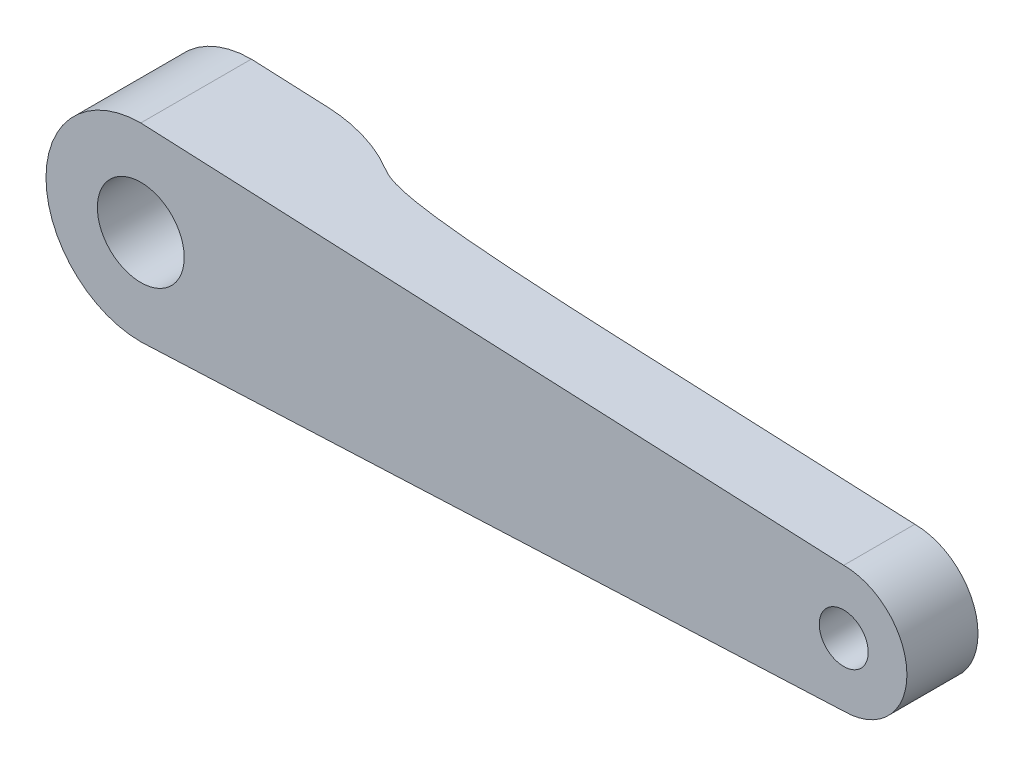
ISO-10303-21;
HEADER;
FILE_DESCRIPTION(('STEP AP214'),'2;1');
FILE_NAME('part.step','',(''),(''),'','','');
FILE_SCHEMA(('AUTOMOTIVE_DESIGN { 1 0 10303 214 1 1 1 1 }'));
ENDSEC;
DATA;
#1=APPLICATION_CONTEXT('core data for automotive mechanical design processes');
#2=APPLICATION_PROTOCOL_DEFINITION('international standard','automotive_design',2000,#1);
#3=PRODUCT_CONTEXT('',#1,'mechanical');
#4=PRODUCT('Part','Part','',(#3));
#5=PRODUCT_RELATED_PRODUCT_CATEGORY('part','',(#4));
#6=PRODUCT_DEFINITION_FORMATION('','',#4);
#7=PRODUCT_DEFINITION_CONTEXT('part definition',#1,'design');
#8=PRODUCT_DEFINITION('design','',#6,#7);
#9=PRODUCT_DEFINITION_SHAPE('','',#8);
#10=(LENGTH_UNIT() NAMED_UNIT(*) SI_UNIT(.MILLI.,.METRE.));
#11=(NAMED_UNIT(*) PLANE_ANGLE_UNIT() SI_UNIT($,.RADIAN.));
#12=(NAMED_UNIT(*) SI_UNIT($,.STERADIAN.) SOLID_ANGLE_UNIT());
#13=UNCERTAINTY_MEASURE_WITH_UNIT(LENGTH_MEASURE(1.E-05),#10,'distance_accuracy_value','');
#14=(GEOMETRIC_REPRESENTATION_CONTEXT(3) GLOBAL_UNCERTAINTY_ASSIGNED_CONTEXT((#13)) GLOBAL_UNIT_ASSIGNED_CONTEXT((#10,
#11,#12)) REPRESENTATION_CONTEXT('',''));
#15=CARTESIAN_POINT('',(0.,0.,0.));
#16=DIRECTION('',(0.,0.,1.));
#17=DIRECTION('',(1.,0.,0.));
#18=AXIS2_PLACEMENT_3D('',#15,#16,#17);
#19=CARTESIAN_POINT('',(0.269119314602494,-5.98790474990551,7.));
#20=DIRECTION('',(-0.0448984968094591,0.998991554010469,0.));
#21=DIRECTION('',(-0.998991554010469,-0.0448984968094591,0.));
#22=AXIS2_PLACEMENT_3D('',#19,#20,#21);
#23=PLANE('',#22);
#24=DIRECTION('',(0.998991554010469,0.0448984968094592,0.));
#25=VECTOR('',#24,1.);
#26=CARTESIAN_POINT('',(0.269119314602494,-5.98790474990551,0.));
#27=LINE('',#26,#25);
#28=CARTESIAN_POINT('',(0.,-6.,0.));
#29=VERTEX_POINT('',#28);
#30=CARTESIAN_POINT('',(4.83224619586164,-5.78282039569161,0.));
#31=VERTEX_POINT('',#30);
#32=EDGE_CURVE('E213',#29,#31,#27,.T.);
#33=ORIENTED_EDGE('',*,*,#32,.T.);
#34=CARTESIAN_POINT('',(4.83224619586164,-5.78282039569161,10.));
#35=DIRECTION('',(-0.0448984968094591,0.998991554010469,0.));
#36=DIRECTION('',(0.998991554010469,0.0448984968094591,0.));
#37=AXIS2_PLACEMENT_3D('',#34,#35,#36);
#38=ELLIPSE('',#37,10.0100946397943,10.);
#39=CARTESIAN_POINT('',(9.92616284542109,-5.55388032155411,1.39465206006515));
#40=VERTEX_POINT('',#39);
#41=EDGE_CURVE('E65',#31,#40,#38,.F.);
#42=ORIENTED_EDGE('',*,*,#41,.T.);
#43=CARTESIAN_POINT('',(9.,-5.59550561797753,0.));
#44=CARTESIAN_POINT('',(9.0197236961108,-5.59461915972536,0.0464110950098341));
#45=CARTESIAN_POINT('',(9.03856608160202,-5.59377231093924,0.0931738483475077));
#46=CARTESIAN_POINT('',(9.07539874100431,-5.59211691051666,0.187406937910348));
#47=CARTESIAN_POINT('',(9.09338229795599,-5.59130866076602,0.234879926602944));
#48=CARTESIAN_POINT('',(9.12921614697412,-5.58969815069779,0.330044521995679));
#49=CARTESIAN_POINT('',(9.14706583393983,-5.58889591757574,0.377736344016202));
#50=CARTESIAN_POINT('',(9.18410247172186,-5.58723134958554,0.473986394272832));
#51=CARTESIAN_POINT('',(9.20331176343384,-5.58636801063219,0.522536249827667));
#52=CARTESIAN_POINT('',(9.24385750871294,-5.58454572994549,0.618588504891965));
#53=CARTESIAN_POINT('',(9.2651874563837,-5.58358708061197,0.666093593449808));
#54=CARTESIAN_POINT('',(9.31120238889283,-5.58151899375763,0.759378646526527));
#55=CARTESIAN_POINT('',(9.33588080052951,-5.5804098516616,0.805161771891768));
#56=CARTESIAN_POINT('',(9.3793077403341,-5.57845807908611,0.87731978617561));
#57=CARTESIAN_POINT('',(9.39676060832497,-5.57767368052472,0.904476152397463));
#58=CARTESIAN_POINT('',(9.43339893405827,-5.57602701419963,0.957631817315344));
#59=CARTESIAN_POINT('',(9.45258589567841,-5.57516467884592,0.983630081919395));
#60=CARTESIAN_POINT('',(9.49267192828292,-5.57336305940302,1.03426553257482));
#61=CARTESIAN_POINT('',(9.51357082697932,-5.57242378305711,1.05890285517348));
#62=CARTESIAN_POINT('',(9.55671679037795,-5.5704846386347,1.10640426568289));
#63=CARTESIAN_POINT('',(9.57894378721268,-5.56948567248483,1.1292866386958));
#64=CARTESIAN_POINT('',(9.62483083420657,-5.56742333329409,1.17356652293696));
#65=CARTESIAN_POINT('',(9.64849105638532,-5.56635995252201,1.19496385526266));
#66=CARTESIAN_POINT('',(9.69706230096039,-5.56417697523774,1.23628019657253));
#67=CARTESIAN_POINT('',(9.72197340087065,-5.56305737524177,1.2561991137528));
#68=CARTESIAN_POINT('',(9.79918101844689,-5.55958736995744,1.31447617522593));
#69=CARTESIAN_POINT('',(9.85316460698408,-5.55716114125914,1.35060820025465));
#70=CARTESIAN_POINT('',(9.96419026942951,-5.55217122384587,1.4177709648512));
#71=CARTESIAN_POINT('',(10.0212343894077,-5.54960744317269,1.44879823391296));
#72=CARTESIAN_POINT('',(10.1381380705169,-5.54435334514531,1.50701729104118));
#73=CARTESIAN_POINT('',(10.1980244258772,-5.54166182355608,1.53415454928966));
#74=CARTESIAN_POINT('',(10.3192200730239,-5.5362148281787,1.58491677180607));
#75=CARTESIAN_POINT('',(10.3805288720795,-5.53345937653575,1.60854293191341));
#76=CARTESIAN_POINT('',(10.5183068780731,-5.52726710660346,1.65804451844934));
#77=CARTESIAN_POINT('',(10.5950334610544,-5.52381872085149,1.68319653668897));
#78=CARTESIAN_POINT('',(10.7495106387791,-5.51687592634701,1.73015459224607));
#79=CARTESIAN_POINT('',(10.8272615344642,-5.51338150406903,1.75195962129346));
#80=CARTESIAN_POINT('',(10.9836083211613,-5.506354682195,1.79293558842061));
#81=CARTESIAN_POINT('',(11.0622055610689,-5.50282222197443,1.81210132314357));
#82=CARTESIAN_POINT('',(11.2199015508644,-5.4957347617589,1.84825314694667));
#83=CARTESIAN_POINT('',(11.2990003485809,-5.49217975961434,1.86523902477332));
#84=CARTESIAN_POINT('',(11.5370015227225,-5.48148307763045,1.91355413212303));
#85=CARTESIAN_POINT('',(11.696446581161,-5.47431700758827,1.94220026094863));
#86=CARTESIAN_POINT('',(12.0160550328165,-5.45995258279477,1.99442393157232));
#87=CARTESIAN_POINT('',(12.1762180363545,-5.4527542455571,2.01800394671231));
#88=CARTESIAN_POINT('',(12.4968041556466,-5.4383458806451,2.06135742149571));
#89=CARTESIAN_POINT('',(12.6572265054988,-5.43113588739331,2.08113661507716));
#90=CARTESIAN_POINT('',(12.9783217731553,-5.41670463940875,2.11777850032749));
#91=CARTESIAN_POINT('',(13.138994538364,-5.4094833915342,2.13464255398597));
#92=CARTESIAN_POINT('',(13.5379181261682,-5.39155424152053,2.17362859752155));
#93=CARTESIAN_POINT('',(13.7763021963195,-5.38084035072722,2.194376776026));
#94=CARTESIAN_POINT('',(14.2533687368337,-5.35939915789512,2.23213792426364));
#95=CARTESIAN_POINT('',(14.4920512205215,-5.34867185525746,2.24915072074234));
#96=CARTESIAN_POINT('',(14.9697396920707,-5.32720271046874,2.28029762025646));
#97=CARTESIAN_POINT('',(15.2087457871137,-5.31646086350051,2.29443005757518));
#98=CARTESIAN_POINT('',(15.6868836383937,-5.29497152186995,2.32039488036477));
#99=CARTESIAN_POINT('',(15.9260153961614,-5.28422402713882,2.33222723713315));
#100=CARTESIAN_POINT('',(16.6422512975503,-5.2520336495483,2.36488474999077));
#101=CARTESIAN_POINT('',(17.1194807027153,-5.23058513695662,2.38294886693849));
#102=CARTESIAN_POINT('',(18.0739894118856,-5.18768586912874,2.41394764347585));
#103=CARTESIAN_POINT('',(18.55126868097,-5.16623511546203,2.42688344723063));
#104=CARTESIAN_POINT('',(19.5539639219039,-5.12117016081331,2.45007431844182));
#105=CARTESIAN_POINT('',(20.0793889781982,-5.09755555154166,2.45992843270219));
#106=CARTESIAN_POINT('',(21.1303347264904,-5.05032203476448,2.47620886283438));
#107=CARTESIAN_POINT('',(21.6558554228272,-5.02670312706395,2.48263488363882));
#108=CARTESIAN_POINT('',(22.706950291218,-4.97946290825987,2.49282830876571));
#109=CARTESIAN_POINT('',(23.2325244646253,-4.9558415970955,2.49659556811273));
#110=CARTESIAN_POINT('',(24.2850214612836,-4.90853836129063,2.50202088129101));
#111=CARTESIAN_POINT('',(24.811944310678,-4.88485643547515,2.50367353956502));
#112=CARTESIAN_POINT('',(25.8657599593421,-4.8374939344116,2.50525436943824));
#113=CARTESIAN_POINT('',(26.3926527584816,-4.81381335916937,2.5051826463527));
#114=CARTESIAN_POINT('',(27.4463647361164,-4.76645551747792,2.50359962789058));
#115=CARTESIAN_POINT('',(27.9731839148872,-4.74277825101631,2.50208852811706));
#116=CARTESIAN_POINT('',(28.5,-4.71910112359551,2.5));
#117=B_SPLINE_CURVE_WITH_KNOTS('',3,(#43,#44,#45,#46,#47,#48,#49,#50,#51,#52,#53,#54,#55,#56,
#57,#58,#59,#60,#61,#62,#63,#64,#65,#66,#67,#68,#69,#70,#71,#72,#73,#74,#75,#76,#77,#78,#79,#80,
#81,#82,#83,#84,#85,#86,#87,#88,#89,#90,#91,#92,#93,#94,#95,#96,#97,#98,#99,#100,#101,#102,#103,
#104,#105,#106,#107,#108,#109,#110,#111,#112,#113,#114,#115,#116),.UNSPECIFIED.,.F.,.F.,(4,2,2,
2,2,2,2,2,2,2,2,2,2,2,2,2,2,2,2,2,2,2,2,2,2,2,2,2,2,2,2,2,2,2,2,2,4),(0.,0.151270301755634,
0.303576241413847,0.456366182702525,0.612998456706788,0.769164220330555,0.92502774229721,
1.02184029168505,1.11873762167671,1.21562521195143,1.31130428022025,1.40699485499084,
1.50269136681471,1.697320615909,1.89208164319371,2.08935041813252,2.28655185086498,
2.52890115312104,2.77132331967133,3.01421677986102,3.25713376150387,3.74346897200961,
4.22956620513448,4.71492425121079,5.20005491544597,5.9185862623827,6.6371509292036,
7.35612997145232,8.07511798520021,9.50922952077278,10.9430209150012,12.5211483535095,
14.0994116047826,15.6777609080511,17.2601295045075,18.8424014592688,20.4244584229967),.UNSPECIFIED.);
#118=CARTESIAN_POINT('',(28.5,-4.71910112359551,2.5));
#119=VERTEX_POINT('',#118);
#120=EDGE_CURVE('E98',#40,#119,#117,.T.);
#121=ORIENTED_EDGE('',*,*,#120,.T.);
#122=DIRECTION('',(0.998991554010469,0.0448984968094591,0.));
#123=VECTOR('',#122,1.);
#124=CARTESIAN_POINT('',(0.269119314602493,-5.98790474990551,2.50000000000001));
#125=LINE('',#124,#123);
#126=CARTESIAN_POINT('',(44.5,-4.00000000000001,2.5));
#127=VERTEX_POINT('',#126);
#128=EDGE_CURVE('E101',#119,#127,#125,.T.);
#129=ORIENTED_EDGE('',*,*,#128,.T.);
#130=DIRECTION('',(0.,0.,-1.));
#131=VECTOR('',#130,1.);
#132=CARTESIAN_POINT('',(44.5,-4.00000000000001,7.));
#133=LINE('',#132,#131);
#134=CARTESIAN_POINT('',(44.5,-4.00000000000001,7.));
#135=VERTEX_POINT('',#134);
#136=EDGE_CURVE('E187',#135,#127,#133,.T.);
#137=ORIENTED_EDGE('',*,*,#136,.F.);
#138=DIRECTION('',(0.998991554010469,0.0448984968094592,0.));
#139=VECTOR('',#138,1.);
#140=CARTESIAN_POINT('',(0.269119314602494,-5.98790474990551,7.));
#141=LINE('',#140,#139);
#142=CARTESIAN_POINT('',(0.,-6.,7.));
#143=VERTEX_POINT('',#142);
#144=EDGE_CURVE('E231',#143,#135,#141,.T.);
#145=ORIENTED_EDGE('',*,*,#144,.F.);
#146=DIRECTION('',(0.,0.,-1.));
#147=VECTOR('',#146,1.);
#148=CARTESIAN_POINT('',(0.,-6.,7.));
#149=LINE('',#148,#147);
#150=EDGE_CURVE('E196',#143,#29,#149,.T.);
#151=ORIENTED_EDGE('',*,*,#150,.T.);
#152=EDGE_LOOP('',(#33,#42,#121,#129,#137,#145,#151));
#153=FACE_BOUND('',#152,.T.);
#154=ADVANCED_FACE('F43',(#153),#23,.F.);
#155=CARTESIAN_POINT('',(44.5,0.,7.));
#156=DIRECTION('',(0.,0.,-1.));
#157=DIRECTION('',(-1.,0.,0.));
#158=AXIS2_PLACEMENT_3D('',#155,#156,#157);
#159=CYLINDRICAL_SURFACE('',#158,4.00000000000001);
#160=CARTESIAN_POINT('',(44.5,0.,2.5));
#161=DIRECTION('',(0.,0.,1.));
#162=DIRECTION('',(1.,0.,0.));
#163=AXIS2_PLACEMENT_3D('',#160,#161,#162);
#164=CIRCLE('',#163,4.00000000000001);
#165=CARTESIAN_POINT('',(44.5,4.00000000000001,2.5));
#166=VERTEX_POINT('',#165);
#167=EDGE_CURVE('E113',#127,#166,#164,.T.);
#168=ORIENTED_EDGE('',*,*,#167,.T.);
#169=DIRECTION('',(0.,0.,-1.));
#170=VECTOR('',#169,1.);
#171=CARTESIAN_POINT('',(44.5,4.00000000000001,7.));
#172=LINE('',#171,#170);
#173=CARTESIAN_POINT('',(44.5,4.00000000000001,7.));
#174=VERTEX_POINT('',#173);
#175=EDGE_CURVE('E185',#174,#166,#172,.T.);
#176=ORIENTED_EDGE('',*,*,#175,.F.);
#177=CARTESIAN_POINT('',(44.5,0.,7.));
#178=DIRECTION('',(0.,0.,1.));
#179=DIRECTION('',(1.,0.,0.));
#180=AXIS2_PLACEMENT_3D('',#177,#178,#179);
#181=CIRCLE('',#180,4.00000000000001);
#182=EDGE_CURVE('E239',#135,#174,#181,.T.);
#183=ORIENTED_EDGE('',*,*,#182,.F.);
#184=ORIENTED_EDGE('',*,*,#136,.T.);
#185=EDGE_LOOP('',(#168,#176,#183,#184));
#186=FACE_BOUND('',#185,.T.);
#187=ADVANCED_FACE('F172',(#186),#159,.T.);
#188=CARTESIAN_POINT('',(0.269119314602494,5.98790474990551,7.));
#189=DIRECTION('',(0.0448984968094591,0.998991554010469,0.));
#190=DIRECTION('',(-0.998991554010469,0.0448984968094591,0.));
#191=AXIS2_PLACEMENT_3D('',#188,#189,#190);
#192=PLANE('',#191);
#193=CARTESIAN_POINT('',(9.,5.59550561797753,0.));
#194=CARTESIAN_POINT('',(9.0197236961108,5.59461915972536,0.0464110950098343));
#195=CARTESIAN_POINT('',(9.03856608160202,5.59377231093924,0.093173848347508));
#196=CARTESIAN_POINT('',(9.07539874100431,5.59211691051666,0.187406937910348));
#197=CARTESIAN_POINT('',(9.09338229795599,5.59130866076602,0.234879926602944));
#198=CARTESIAN_POINT('',(9.12921614697412,5.58969815069779,0.330044521995679));
#199=CARTESIAN_POINT('',(9.14706583393983,5.58889591757574,0.377736344016202));
#200=CARTESIAN_POINT('',(9.18410247172186,5.58723134958554,0.473986394272832));
#201=CARTESIAN_POINT('',(9.20331176343384,5.58636801063219,0.522536249827666));
#202=CARTESIAN_POINT('',(9.24385750871294,5.58454572994549,0.618588504891964));
#203=CARTESIAN_POINT('',(9.2651874563837,5.58358708061197,0.666093593449808));
#204=CARTESIAN_POINT('',(9.31120238889283,5.58151899375763,0.759378646526527));
#205=CARTESIAN_POINT('',(9.3358808005295,5.5804098516616,0.805161771891768));
#206=CARTESIAN_POINT('',(9.3793077403341,5.57845807908611,0.87731978617561));
#207=CARTESIAN_POINT('',(9.39676060832497,5.57767368052472,0.904476152397463));
#208=CARTESIAN_POINT('',(9.43339893405828,5.57602701419963,0.957631817315344));
#209=CARTESIAN_POINT('',(9.45258589567841,5.57516467884592,0.983630081919393));
#210=CARTESIAN_POINT('',(9.49267192828292,5.57336305940302,1.03426553257482));
#211=CARTESIAN_POINT('',(9.51357082697932,5.57242378305711,1.05890285517348));
#212=CARTESIAN_POINT('',(9.55671679037795,5.5704846386347,1.1064042656829));
#213=CARTESIAN_POINT('',(9.57894378721268,5.56948567248483,1.1292866386958));
#214=CARTESIAN_POINT('',(9.62483083420658,5.56742333329409,1.17356652293696));
#215=CARTESIAN_POINT('',(9.64849105638532,5.56635995252201,1.19496385526266));
#216=CARTESIAN_POINT('',(9.6970623009604,5.56417697523774,1.23628019657252));
#217=CARTESIAN_POINT('',(9.72197340087065,5.56305737524177,1.2561991137528));
#218=CARTESIAN_POINT('',(9.79918101844689,5.55958736995744,1.31447617522593));
#219=CARTESIAN_POINT('',(9.85316460698408,5.55716114125914,1.35060820025465));
#220=CARTESIAN_POINT('',(9.96419026942951,5.55217122384587,1.4177709648512));
#221=CARTESIAN_POINT('',(10.0212343894077,5.54960744317269,1.44879823391296));
#222=CARTESIAN_POINT('',(10.1381380705169,5.54435334514531,1.50701729104118));
#223=CARTESIAN_POINT('',(10.1980244258772,5.54166182355608,1.53415454928966));
#224=CARTESIAN_POINT('',(10.3192200730239,5.5362148281787,1.58491677180607));
#225=CARTESIAN_POINT('',(10.3805288720795,5.53345937653575,1.60854293191341));
#226=CARTESIAN_POINT('',(10.5183068780731,5.52726710660346,1.65804451844934));
#227=CARTESIAN_POINT('',(10.5950334610544,5.52381872085149,1.68319653668897));
#228=CARTESIAN_POINT('',(10.7495106387791,5.51687592634701,1.73015459224607));
#229=CARTESIAN_POINT('',(10.8272615344642,5.51338150406903,1.75195962129345));
#230=CARTESIAN_POINT('',(10.9836083211613,5.506354682195,1.79293558842061));
#231=CARTESIAN_POINT('',(11.0622055610689,5.50282222197443,1.81210132314357));
#232=CARTESIAN_POINT('',(11.2199015508644,5.4957347617589,1.84825314694666));
#233=CARTESIAN_POINT('',(11.2990003485809,5.49217975961434,1.86523902477332));
#234=CARTESIAN_POINT('',(11.5370015227225,5.48148307763045,1.91355413212303));
#235=CARTESIAN_POINT('',(11.696446581161,5.47431700758827,1.94220026094863));
#236=CARTESIAN_POINT('',(12.0160550328165,5.45995258279477,1.99442393157232));
#237=CARTESIAN_POINT('',(12.1762180363545,5.4527542455571,2.0180039467123));
#238=CARTESIAN_POINT('',(12.4968041556466,5.4383458806451,2.06135742149571));
#239=CARTESIAN_POINT('',(12.6572265054988,5.43113588739331,2.08113661507716));
#240=CARTESIAN_POINT('',(12.9783217731553,5.41670463940875,2.11777850032749));
#241=CARTESIAN_POINT('',(13.138994538364,5.40948339153421,2.13464255398597));
#242=CARTESIAN_POINT('',(13.5379181261682,5.39155424152053,2.17362859752155));
#243=CARTESIAN_POINT('',(13.7763021963195,5.38084035072722,2.194376776026));
#244=CARTESIAN_POINT('',(14.2533687368337,5.35939915789512,2.23213792426364));
#245=CARTESIAN_POINT('',(14.4920512205215,5.34867185525746,2.24915072074234));
#246=CARTESIAN_POINT('',(14.9697396920706,5.32720271046874,2.28029762025646));
#247=CARTESIAN_POINT('',(15.2087457871137,5.31646086350051,2.29443005757518));
#248=CARTESIAN_POINT('',(15.6868836383936,5.29497152186995,2.32039488036477));
#249=CARTESIAN_POINT('',(15.9260153961614,5.28422402713882,2.33222723713315));
#250=CARTESIAN_POINT('',(16.6422512975503,5.2520336495483,2.36488474999077));
#251=CARTESIAN_POINT('',(17.1194807027153,5.23058513695662,2.38294886693848));
#252=CARTESIAN_POINT('',(18.0739894118856,5.18768586912874,2.41394764347585));
#253=CARTESIAN_POINT('',(18.5512686809699,5.16623511546203,2.42688344723062));
#254=CARTESIAN_POINT('',(19.5539639219039,5.12117016081331,2.45007431844182));
#255=CARTESIAN_POINT('',(20.0793889781982,5.09755555154166,2.45992843270219));
#256=CARTESIAN_POINT('',(21.1303347264904,5.05032203476448,2.47620886283438));
#257=CARTESIAN_POINT('',(21.6558554228272,5.02670312706395,2.48263488363882));
#258=CARTESIAN_POINT('',(22.706950291218,4.97946290825987,2.49282830876571));
#259=CARTESIAN_POINT('',(23.2325244646253,4.9558415970955,2.49659556811273));
#260=CARTESIAN_POINT('',(24.2850214612836,4.90853836129063,2.50202088129101));
#261=CARTESIAN_POINT('',(24.811944310678,4.88485643547515,2.50367353956502));
#262=CARTESIAN_POINT('',(25.8657599593421,4.83749393441159,2.50525436943824));
#263=CARTESIAN_POINT('',(26.3926527584816,4.81381335916937,2.5051826463527));
#264=CARTESIAN_POINT('',(27.4463647361164,4.76645551747792,2.50359962789058));
#265=CARTESIAN_POINT('',(27.9731839148872,4.74277825101631,2.50208852811706));
#266=CARTESIAN_POINT('',(28.5,4.71910112359551,2.5));
#267=B_SPLINE_CURVE_WITH_KNOTS('',3,(#193,#194,#195,#196,#197,#198,#199,#200,#201,#202,#203,
#204,#205,#206,#207,#208,#209,#210,#211,#212,#213,#214,#215,#216,#217,#218,#219,#220,#221,#222,
#223,#224,#225,#226,#227,#228,#229,#230,#231,#232,#233,#234,#235,#236,#237,#238,#239,#240,#241,
#242,#243,#244,#245,#246,#247,#248,#249,#250,#251,#252,#253,#254,#255,#256,#257,#258,#259,#260,
#261,#262,#263,#264,#265,#266),.UNSPECIFIED.,.F.,.F.,(4,2,2,2,2,2,2,2,2,2,2,2,2,2,2,2,2,2,2,2,2,
2,2,2,2,2,2,2,2,2,2,2,2,2,2,2,4),(0.,0.151270301755635,0.303576241413847,0.456366182702525,
0.612998456706788,0.769164220330554,0.92502774229721,1.02184029168505,1.11873762167671,
1.21562521195143,1.31130428022025,1.40699485499084,1.50269136681471,1.697320615909,
1.89208164319371,2.08935041813252,2.28655185086498,2.52890115312104,2.77132331967133,
3.01421677986101,3.25713376150387,3.7434689720096,4.22956620513448,4.71492425121078,
5.20005491544596,5.91858626238269,6.63715092920359,7.3561299714523,8.0751179852002,
9.50922952077275,10.9430209150011,12.5211483535095,14.0994116047826,15.6777609080511,
17.2601295045075,18.8424014592687,20.4244584229967),.UNSPECIFIED.);
#268=CARTESIAN_POINT('',(9.92616284542109,5.55388032155411,1.39465206006515));
#269=VERTEX_POINT('',#268);
#270=CARTESIAN_POINT('',(28.5,4.71910112359551,2.5));
#271=VERTEX_POINT('',#270);
#272=EDGE_CURVE('E105',#269,#271,#267,.T.);
#273=ORIENTED_EDGE('',*,*,#272,.F.);
#274=CARTESIAN_POINT('',(4.83224619586164,5.78282039569161,10.));
#275=DIRECTION('',(0.0448984968094591,0.998991554010469,0.));
#276=DIRECTION('',(-0.998991554010469,0.0448984968094591,0.));
#277=AXIS2_PLACEMENT_3D('',#274,#275,#276);
#278=ELLIPSE('',#277,10.0100946397943,10.);
#279=CARTESIAN_POINT('',(4.83224619586164,5.78282039569161,0.));
#280=VERTEX_POINT('',#279);
#281=EDGE_CURVE('E11',#269,#280,#278,.T.);
#282=ORIENTED_EDGE('',*,*,#281,.T.);
#283=DIRECTION('',(0.998991554010469,-0.0448984968094592,0.));
#284=VECTOR('',#283,1.);
#285=CARTESIAN_POINT('',(0.269119314602494,5.98790474990551,0.));
#286=LINE('',#285,#284);
#287=CARTESIAN_POINT('',(0.,6.,0.));
#288=VERTEX_POINT('',#287);
#289=EDGE_CURVE('E215',#288,#280,#286,.T.);
#290=ORIENTED_EDGE('',*,*,#289,.F.);
#291=DIRECTION('',(0.,0.,-1.));
#292=VECTOR('',#291,1.);
#293=CARTESIAN_POINT('',(0.,6.,7.));
#294=LINE('',#293,#292);
#295=CARTESIAN_POINT('',(0.,6.,7.));
#296=VERTEX_POINT('',#295);
#297=EDGE_CURVE('E192',#296,#288,#294,.T.);
#298=ORIENTED_EDGE('',*,*,#297,.F.);
#299=DIRECTION('',(0.998991554010469,-0.0448984968094592,0.));
#300=VECTOR('',#299,1.);
#301=CARTESIAN_POINT('',(0.269119314602494,5.98790474990551,7.));
#302=LINE('',#301,#300);
#303=EDGE_CURVE('E191',#296,#174,#302,.T.);
#304=ORIENTED_EDGE('',*,*,#303,.T.);
#305=ORIENTED_EDGE('',*,*,#175,.T.);
#306=DIRECTION('',(0.998991554010469,-0.0448984968094591,0.));
#307=VECTOR('',#306,1.);
#308=CARTESIAN_POINT('',(0.269119314602493,5.98790474990551,2.50000000000001));
#309=LINE('',#308,#307);
#310=EDGE_CURVE('E188',#271,#166,#309,.T.);
#311=ORIENTED_EDGE('',*,*,#310,.F.);
#312=EDGE_LOOP('',(#273,#282,#290,#298,#304,#305,#311));
#313=FACE_BOUND('',#312,.T.);
#314=ADVANCED_FACE('F134',(#313),#192,.T.);
#315=CARTESIAN_POINT('',(0.,0.,7.));
#316=DIRECTION('',(0.,0.,-1.));
#317=DIRECTION('',(-1.,0.,0.));
#318=AXIS2_PLACEMENT_3D('',#315,#316,#317);
#319=CYLINDRICAL_SURFACE('',#318,6.);
#320=CARTESIAN_POINT('',(0.,0.,0.));
#321=DIRECTION('',(0.,0.,1.));
#322=DIRECTION('',(1.,0.,0.));
#323=AXIS2_PLACEMENT_3D('',#320,#321,#322);
#324=CIRCLE('',#323,6.);
#325=EDGE_CURVE('E223',#288,#29,#324,.T.);
#326=ORIENTED_EDGE('',*,*,#325,.T.);
#327=ORIENTED_EDGE('',*,*,#150,.F.);
#328=CARTESIAN_POINT('',(0.,0.,7.));
#329=DIRECTION('',(0.,0.,1.));
#330=DIRECTION('',(1.,0.,0.));
#331=AXIS2_PLACEMENT_3D('',#328,#329,#330);
#332=CIRCLE('',#331,6.);
#333=EDGE_CURVE('E233',#296,#143,#332,.T.);
#334=ORIENTED_EDGE('',*,*,#333,.F.);
#335=ORIENTED_EDGE('',*,*,#297,.T.);
#336=EDGE_LOOP('',(#326,#327,#334,#335));
#337=FACE_BOUND('',#336,.T.);
#338=ADVANCED_FACE('F165',(#337),#319,.T.);
#339=CARTESIAN_POINT('',(44.5,0.,7.));
#340=DIRECTION('',(0.,0.,-1.));
#341=DIRECTION('',(-1.,0.,0.));
#342=AXIS2_PLACEMENT_3D('',#339,#340,#341);
#343=CYLINDRICAL_SURFACE('',#342,1.55);
#344=CARTESIAN_POINT('',(44.5,0.,2.5));
#345=DIRECTION('',(0.,0.,1.));
#346=DIRECTION('',(1.,0.,0.));
#347=AXIS2_PLACEMENT_3D('',#344,#345,#346);
#348=CIRCLE('',#347,1.55);
#349=CARTESIAN_POINT('',(46.05,0.,2.5));
#350=VERTEX_POINT('',#349);
#351=EDGE_CURVE('E104',#350,#350,#348,.T.);
#352=ORIENTED_EDGE('',*,*,#351,.F.);
#353=EDGE_LOOP('',(#352));
#354=FACE_BOUND('',#353,.T.);
#355=CARTESIAN_POINT('',(44.5,0.,7.));
#356=DIRECTION('',(0.,0.,1.));
#357=DIRECTION('',(1.,0.,0.));
#358=AXIS2_PLACEMENT_3D('',#355,#356,#357);
#359=CIRCLE('',#358,1.55);
#360=CARTESIAN_POINT('',(46.05,0.,7.));
#361=VERTEX_POINT('',#360);
#362=EDGE_CURVE('E228',#361,#361,#359,.T.);
#363=ORIENTED_EDGE('',*,*,#362,.T.);
#364=EDGE_LOOP('',(#363));
#365=FACE_BOUND('',#364,.T.);
#366=ADVANCED_FACE('F159',(#354,#365),#343,.F.);
#367=CARTESIAN_POINT('',(0.,0.,7.));
#368=DIRECTION('',(0.,0.,1.));
#369=DIRECTION('',(1.,0.,0.));
#370=AXIS2_PLACEMENT_3D('',#367,#368,#369);
#371=PLANE('',#370);
#372=CARTESIAN_POINT('',(0.,0.,7.));
#373=DIRECTION('',(0.,0.,1.));
#374=DIRECTION('',(1.,0.,0.));
#375=AXIS2_PLACEMENT_3D('',#372,#373,#374);
#376=CIRCLE('',#375,2.75);
#377=CARTESIAN_POINT('',(2.75,0.,7.));
#378=VERTEX_POINT('',#377);
#379=EDGE_CURVE('E203',#378,#378,#376,.T.);
#380=ORIENTED_EDGE('',*,*,#379,.F.);
#381=EDGE_LOOP('',(#380));
#382=FACE_BOUND('',#381,.T.);
#383=ORIENTED_EDGE('',*,*,#144,.T.);
#384=ORIENTED_EDGE('',*,*,#182,.T.);
#385=ORIENTED_EDGE('',*,*,#303,.F.);
#386=ORIENTED_EDGE('',*,*,#333,.T.);
#387=EDGE_LOOP('',(#383,#384,#385,#386));
#388=FACE_BOUND('',#387,.T.);
#389=ORIENTED_EDGE('',*,*,#362,.F.);
#390=EDGE_LOOP('',(#389));
#391=FACE_BOUND('',#390,.T.);
#392=ADVANCED_FACE('F156',(#382,#388,#391),#371,.T.);
#393=CARTESIAN_POINT('',(0.,0.,0.));
#394=DIRECTION('',(0.,0.,1.));
#395=DIRECTION('',(1.,0.,0.));
#396=AXIS2_PLACEMENT_3D('',#393,#394,#395);
#397=PLANE('',#396);
#398=CARTESIAN_POINT('',(0.,0.,0.));
#399=DIRECTION('',(0.,0.,-1.));
#400=DIRECTION('',(-1.,0.,0.));
#401=AXIS2_PLACEMENT_3D('',#398,#399,#400);
#402=CIRCLE('',#401,1.75);
#403=CARTESIAN_POINT('',(-1.75,0.,0.));
#404=VERTEX_POINT('',#403);
#405=EDGE_CURVE('E114',#404,#404,#402,.T.);
#406=ORIENTED_EDGE('',*,*,#405,.F.);
#407=EDGE_LOOP('',(#406));
#408=FACE_BOUND('',#407,.T.);
#409=ORIENTED_EDGE('',*,*,#289,.T.);
#410=DIRECTION('',(0.,1.,0.));
#411=VECTOR('',#410,1.);
#412=CARTESIAN_POINT('',(4.83224619586164,0.,0.));
#413=LINE('',#412,#411);
#414=EDGE_CURVE('E194',#280,#31,#413,.F.);
#415=ORIENTED_EDGE('',*,*,#414,.T.);
#416=ORIENTED_EDGE('',*,*,#32,.F.);
#417=ORIENTED_EDGE('',*,*,#325,.F.);
#418=EDGE_LOOP('',(#409,#415,#416,#417));
#419=FACE_BOUND('',#418,.T.);
#420=ADVANCED_FACE('F154',(#408,#419),#397,.F.);
#421=CARTESIAN_POINT('',(0.,0.,2.));
#422=DIRECTION('',(0.,0.,1.));
#423=DIRECTION('',(1.,0.,0.));
#424=AXIS2_PLACEMENT_3D('',#421,#422,#423);
#425=CYLINDRICAL_SURFACE('',#424,2.75);
#426=CARTESIAN_POINT('',(0.,0.,2.));
#427=DIRECTION('',(0.,0.,1.));
#428=DIRECTION('',(1.,0.,0.));
#429=AXIS2_PLACEMENT_3D('',#426,#427,#428);
#430=CIRCLE('',#429,2.75);
#431=CARTESIAN_POINT('',(2.75,0.,2.));
#432=VERTEX_POINT('',#431);
#433=EDGE_CURVE('E221',#432,#432,#430,.T.);
#434=ORIENTED_EDGE('',*,*,#433,.F.);
#435=EDGE_LOOP('',(#434));
#436=FACE_BOUND('',#435,.T.);
#437=ORIENTED_EDGE('',*,*,#379,.T.);
#438=EDGE_LOOP('',(#437));
#439=FACE_BOUND('',#438,.T.);
#440=ADVANCED_FACE('F150',(#436,#439),#425,.F.);
#441=CARTESIAN_POINT('',(0.,0.,2.));
#442=DIRECTION('',(0.,0.,1.));
#443=DIRECTION('',(1.,0.,0.));
#444=AXIS2_PLACEMENT_3D('',#441,#442,#443);
#445=PLANE('',#444);
#446=CARTESIAN_POINT('',(0.,0.,2.));
#447=DIRECTION('',(0.,0.,1.));
#448=DIRECTION('',(1.,0.,0.));
#449=AXIS2_PLACEMENT_3D('',#446,#447,#448);
#450=CIRCLE('',#449,1.75);
#451=CARTESIAN_POINT('',(1.75,0.,2.));
#452=VERTEX_POINT('',#451);
#453=EDGE_CURVE('E200',#452,#452,#450,.T.);
#454=ORIENTED_EDGE('',*,*,#453,.F.);
#455=EDGE_LOOP('',(#454));
#456=FACE_BOUND('',#455,.T.);
#457=ORIENTED_EDGE('',*,*,#433,.T.);
#458=EDGE_LOOP('',(#457));
#459=FACE_BOUND('',#458,.T.);
#460=ADVANCED_FACE('F146',(#456,#459),#445,.T.);
#461=CARTESIAN_POINT('',(0.,0.,5.));
#462=DIRECTION('',(0.,0.,-1.));
#463=DIRECTION('',(-1.,0.,0.));
#464=AXIS2_PLACEMENT_3D('',#461,#462,#463);
#465=CYLINDRICAL_SURFACE('',#464,1.75);
#466=ORIENTED_EDGE('',*,*,#453,.T.);
#467=EDGE_LOOP('',(#466));
#468=FACE_BOUND('',#467,.T.);
#469=ORIENTED_EDGE('',*,*,#405,.T.);
#470=EDGE_LOOP('',(#469));
#471=FACE_BOUND('',#470,.T.);
#472=ADVANCED_FACE('F142',(#468,#471),#465,.F.);
#473=CARTESIAN_POINT('',(48.5,-6.,2.5));
#474=DIRECTION('',(0.,0.,1.));
#475=DIRECTION('',(1.,0.,0.));
#476=AXIS2_PLACEMENT_3D('',#473,#474,#475);
#477=PLANE('',#476);
#478=ORIENTED_EDGE('',*,*,#351,.T.);
#479=EDGE_LOOP('',(#478));
#480=FACE_BOUND('',#479,.T.);
#481=DIRECTION('',(0.,1.,0.));
#482=VECTOR('',#481,1.);
#483=CARTESIAN_POINT('',(28.5,-6.,2.5));
#484=LINE('',#483,#482);
#485=EDGE_CURVE('E111',#119,#271,#484,.T.);
#486=ORIENTED_EDGE('',*,*,#485,.T.);
#487=ORIENTED_EDGE('',*,*,#310,.T.);
#488=ORIENTED_EDGE('',*,*,#167,.F.);
#489=ORIENTED_EDGE('',*,*,#128,.F.);
#490=EDGE_LOOP('',(#486,#487,#488,#489));
#491=FACE_BOUND('',#490,.T.);
#492=ADVANCED_FACE('F109',(#480,#491),#477,.F.);
#493=CARTESIAN_POINT('',(9.,-6.,0.));
#494=CARTESIAN_POINT('',(9.73454277513629,-6.,1.73207559780652));
#495=CARTESIAN_POINT('',(8.77219140461031,-6.,2.578671178641));
#496=CARTESIAN_POINT('',(28.5,-6.,2.5));
#497=B_SPLINE_CURVE_WITH_KNOTS('',3,(#493,#494,#495,#496),.UNSPECIFIED.,.F.,.F.,(4,4),(0.,1.),.UNSPECIFIED.);
#498=DIRECTION('',(0.,1.,0.));
#499=VECTOR('',#498,1.);
#500=SURFACE_OF_LINEAR_EXTRUSION('',#497,#499);
#501=ORIENTED_EDGE('',*,*,#120,.F.);
#502=DIRECTION('',(0.,1.,0.));
#503=VECTOR('',#502,1.);
#504=CARTESIAN_POINT('',(9.92616284542109,-5.55388032155411,1.39465206006515));
#505=LINE('',#504,#503);
#506=EDGE_CURVE('E51',#40,#269,#505,.T.);
#507=ORIENTED_EDGE('',*,*,#506,.T.);
#508=ORIENTED_EDGE('',*,*,#272,.T.);
#509=ORIENTED_EDGE('',*,*,#485,.F.);
#510=EDGE_LOOP('',(#501,#507,#508,#509));
#511=FACE_BOUND('',#510,.T.);
#512=ADVANCED_FACE('F116',(#511),#500,.F.);
#513=CARTESIAN_POINT('',(4.83224619586164,5.55388032155411,10.));
#514=DIRECTION('',(0.,1.,0.));
#515=DIRECTION('',(0.,0.,1.));
#516=AXIS2_PLACEMENT_3D('',#513,#514,#515);
#517=CYLINDRICAL_SURFACE('',#516,10.);
#518=ORIENTED_EDGE('',*,*,#281,.F.);
#519=ORIENTED_EDGE('',*,*,#506,.F.);
#520=ORIENTED_EDGE('',*,*,#41,.F.);
#521=ORIENTED_EDGE('',*,*,#414,.F.);
#522=EDGE_LOOP('',(#518,#519,#520,#521));
#523=FACE_BOUND('',#522,.T.);
#524=ADVANCED_FACE('F45',(#523),#517,.T.);
#525=CLOSED_SHELL('',(#154,#187,#314,#338,#366,#392,#420,#440,#460,#472,#492,#512,#524));
#526=MANIFOLD_SOLID_BREP('B2',#525);
#527=ADVANCED_BREP_SHAPE_REPRESENTATION('',(#18,#526),#14);
#528=SHAPE_DEFINITION_REPRESENTATION(#9,#527);
ENDSEC;
END-ISO-10303-21;
